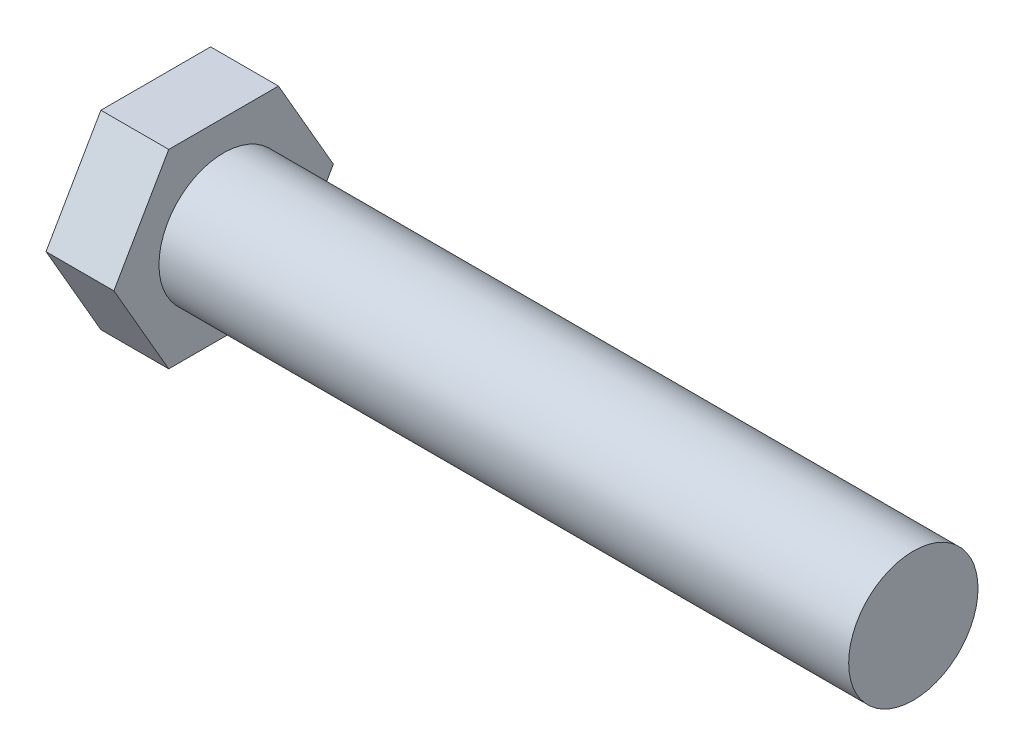
ISO-10303-21;
HEADER;
FILE_DESCRIPTION(('STEP AP214'),'2;1');
FILE_NAME('part.step','',(''),(''),'','','');
FILE_SCHEMA(('AUTOMOTIVE_DESIGN { 1 0 10303 214 1 1 1 1 }'));
ENDSEC;
DATA;
#1=APPLICATION_CONTEXT('core data for automotive mechanical design processes');
#2=APPLICATION_PROTOCOL_DEFINITION('international standard','automotive_design',2000,#1);
#3=PRODUCT_CONTEXT('',#1,'mechanical');
#4=PRODUCT('Part','Part','',(#3));
#5=PRODUCT_RELATED_PRODUCT_CATEGORY('part','',(#4));
#6=PRODUCT_DEFINITION_FORMATION('','',#4);
#7=PRODUCT_DEFINITION_CONTEXT('part definition',#1,'design');
#8=PRODUCT_DEFINITION('design','',#6,#7);
#9=PRODUCT_DEFINITION_SHAPE('','',#8);
#10=(LENGTH_UNIT() NAMED_UNIT(*) SI_UNIT(.MILLI.,.METRE.));
#11=(NAMED_UNIT(*) PLANE_ANGLE_UNIT() SI_UNIT($,.RADIAN.));
#12=(NAMED_UNIT(*) SI_UNIT($,.STERADIAN.) SOLID_ANGLE_UNIT());
#13=UNCERTAINTY_MEASURE_WITH_UNIT(LENGTH_MEASURE(1.E-05),#10,'distance_accuracy_value','');
#14=(GEOMETRIC_REPRESENTATION_CONTEXT(3) GLOBAL_UNCERTAINTY_ASSIGNED_CONTEXT((#13)) GLOBAL_UNIT_ASSIGNED_CONTEXT((#10,
#11,#12)) REPRESENTATION_CONTEXT('',''));
#15=CARTESIAN_POINT('',(0.,0.,0.));
#16=DIRECTION('',(0.,0.,1.));
#17=DIRECTION('',(1.,0.,0.));
#18=AXIS2_PLACEMENT_3D('',#15,#16,#17);
#19=CARTESIAN_POINT('',(50.8,0.,0.));
#20=DIRECTION('',(-1.,0.,0.));
#21=DIRECTION('',(0.,0.,1.));
#22=AXIS2_PLACEMENT_3D('',#19,#20,#21);
#23=CYLINDRICAL_SURFACE('',#22,4.7625);
#24=CARTESIAN_POINT('',(50.8,0.,0.));
#25=DIRECTION('',(1.,0.,0.));
#26=DIRECTION('',(0.,0.,-1.));
#27=AXIS2_PLACEMENT_3D('',#24,#25,#26);
#28=CIRCLE('',#27,4.7625);
#29=CARTESIAN_POINT('',(50.8,0.,-4.7625));
#30=VERTEX_POINT('',#29);
#31=EDGE_CURVE('E11',#30,#30,#28,.T.);
#32=ORIENTED_EDGE('',*,*,#31,.F.);
#33=EDGE_LOOP('',(#32));
#34=FACE_BOUND('',#33,.T.);
#35=CARTESIAN_POINT('',(0.,0.,0.));
#36=DIRECTION('',(-1.,0.,0.));
#37=DIRECTION('',(0.,0.,1.));
#38=AXIS2_PLACEMENT_3D('',#35,#36,#37);
#39=CIRCLE('',#38,4.7625);
#40=CARTESIAN_POINT('',(0.,0.,4.7625));
#41=VERTEX_POINT('',#40);
#42=EDGE_CURVE('E41',#41,#41,#39,.T.);
#43=ORIENTED_EDGE('',*,*,#42,.F.);
#44=EDGE_LOOP('',(#43));
#45=FACE_BOUND('',#44,.T.);
#46=ADVANCED_FACE('F33',(#34,#45),#23,.T.);
#47=CARTESIAN_POINT('',(50.8,0.,0.));
#48=DIRECTION('',(1.,0.,0.));
#49=DIRECTION('',(0.,0.,-1.));
#50=AXIS2_PLACEMENT_3D('',#47,#48,#49);
#51=PLANE('',#50);
#52=ORIENTED_EDGE('',*,*,#31,.T.);
#53=EDGE_LOOP('',(#52));
#54=FACE_BOUND('',#53,.T.);
#55=ADVANCED_FACE('F142',(#54),#51,.T.);
#56=CARTESIAN_POINT('',(0.,0.,0.));
#57=DIRECTION('',(-1.,0.,0.));
#58=DIRECTION('',(0.,0.,1.));
#59=AXIS2_PLACEMENT_3D('',#56,#57,#58);
#60=PLANE('',#59);
#61=DIRECTION('',(0.,0.866025403784439,0.5));
#62=VECTOR('',#61,1.);
#63=CARTESIAN_POINT('',(0.,-7.00000000000001,4.04145188432738));
#64=LINE('',#63,#62);
#65=CARTESIAN_POINT('',(0.,-7.00000000000001,4.04145188432738));
#66=VERTEX_POINT('',#65);
#67=CARTESIAN_POINT('',(0.,0.,8.08290376865477));
#68=VERTEX_POINT('',#67);
#69=EDGE_CURVE('E118',#66,#68,#64,.T.);
#70=ORIENTED_EDGE('',*,*,#69,.F.);
#71=DIRECTION('',(0.,0.,1.));
#72=VECTOR('',#71,1.);
#73=CARTESIAN_POINT('',(0.,-7.00000000000001,-4.04145188432739));
#74=LINE('',#73,#72);
#75=CARTESIAN_POINT('',(0.,-7.00000000000001,-4.04145188432739));
#76=VERTEX_POINT('',#75);
#77=EDGE_CURVE('E78',#76,#66,#74,.T.);
#78=ORIENTED_EDGE('',*,*,#77,.F.);
#79=DIRECTION('',(0.,-0.866025403784439,0.5));
#80=VECTOR('',#79,1.);
#81=CARTESIAN_POINT('',(0.,0.,-8.08290376865477));
#82=LINE('',#81,#80);
#83=CARTESIAN_POINT('',(0.,0.,-8.08290376865477));
#84=VERTEX_POINT('',#83);
#85=EDGE_CURVE('E72',#84,#76,#82,.T.);
#86=ORIENTED_EDGE('',*,*,#85,.F.);
#87=DIRECTION('',(0.,-0.866025403784439,-0.5));
#88=VECTOR('',#87,1.);
#89=CARTESIAN_POINT('',(0.,7.00000000000002,-4.04145188432739));
#90=LINE('',#89,#88);
#91=CARTESIAN_POINT('',(0.,7.00000000000002,-4.04145188432739));
#92=VERTEX_POINT('',#91);
#93=EDGE_CURVE('E108',#92,#84,#90,.T.);
#94=ORIENTED_EDGE('',*,*,#93,.F.);
#95=DIRECTION('',(0.,0.,-1.));
#96=VECTOR('',#95,1.);
#97=CARTESIAN_POINT('',(0.,7.00000000000002,4.04145188432738));
#98=LINE('',#97,#96);
#99=CARTESIAN_POINT('',(0.,7.00000000000002,4.04145188432738));
#100=VERTEX_POINT('',#99);
#101=EDGE_CURVE('E123',#100,#92,#98,.T.);
#102=ORIENTED_EDGE('',*,*,#101,.F.);
#103=DIRECTION('',(0.,0.866025403784439,-0.5));
#104=VECTOR('',#103,1.);
#105=CARTESIAN_POINT('',(0.,0.,8.08290376865477));
#106=LINE('',#105,#104);
#107=EDGE_CURVE('E121',#68,#100,#106,.T.);
#108=ORIENTED_EDGE('',*,*,#107,.F.);
#109=EDGE_LOOP('',(#70,#78,#86,#94,#102,#108));
#110=FACE_BOUND('',#109,.T.);
#111=ORIENTED_EDGE('',*,*,#42,.T.);
#112=EDGE_LOOP('',(#111));
#113=FACE_BOUND('',#112,.T.);
#114=ADVANCED_FACE('F139',(#110,#113),#60,.F.);
#115=CARTESIAN_POINT('',(-5.,-7.00000000000001,4.04145188432738));
#116=DIRECTION('',(0.,0.5,-0.866025403784439));
#117=DIRECTION('',(0.,0.866025403784439,0.5));
#118=AXIS2_PLACEMENT_3D('',#115,#116,#117);
#119=PLANE('',#118);
#120=ORIENTED_EDGE('',*,*,#69,.T.);
#121=DIRECTION('',(1.,0.,0.));
#122=VECTOR('',#121,1.);
#123=CARTESIAN_POINT('',(-5.,0.,8.08290376865477));
#124=LINE('',#123,#122);
#125=CARTESIAN_POINT('',(-5.,0.,8.08290376865477));
#126=VERTEX_POINT('',#125);
#127=EDGE_CURVE('E135',#126,#68,#124,.T.);
#128=ORIENTED_EDGE('',*,*,#127,.F.);
#129=DIRECTION('',(0.,0.866025403784439,0.5));
#130=VECTOR('',#129,1.);
#131=CARTESIAN_POINT('',(-5.,-7.00000000000001,4.04145188432738));
#132=LINE('',#131,#130);
#133=CARTESIAN_POINT('',(-5.,-7.00000000000001,4.04145188432738));
#134=VERTEX_POINT('',#133);
#135=EDGE_CURVE('E128',#134,#126,#132,.T.);
#136=ORIENTED_EDGE('',*,*,#135,.F.);
#137=DIRECTION('',(1.,0.,0.));
#138=VECTOR('',#137,1.);
#139=CARTESIAN_POINT('',(-5.,-7.00000000000001,4.04145188432738));
#140=LINE('',#139,#138);
#141=EDGE_CURVE('E114',#134,#66,#140,.T.);
#142=ORIENTED_EDGE('',*,*,#141,.T.);
#143=EDGE_LOOP('',(#120,#128,#136,#142));
#144=FACE_BOUND('',#143,.T.);
#145=ADVANCED_FACE('F152',(#144),#119,.F.);
#146=CARTESIAN_POINT('',(-5.,0.,8.08290376865477));
#147=DIRECTION('',(0.,-0.5,-0.866025403784438));
#148=DIRECTION('',(0.,0.866025403784438,-0.5));
#149=AXIS2_PLACEMENT_3D('',#146,#147,#148);
#150=PLANE('',#149);
#151=ORIENTED_EDGE('',*,*,#107,.T.);
#152=DIRECTION('',(1.,0.,0.));
#153=VECTOR('',#152,1.);
#154=CARTESIAN_POINT('',(-5.,7.00000000000002,4.04145188432738));
#155=LINE('',#154,#153);
#156=CARTESIAN_POINT('',(-5.,7.00000000000002,4.04145188432738));
#157=VERTEX_POINT('',#156);
#158=EDGE_CURVE('E132',#157,#100,#155,.T.);
#159=ORIENTED_EDGE('',*,*,#158,.F.);
#160=DIRECTION('',(0.,0.866025403784439,-0.5));
#161=VECTOR('',#160,1.);
#162=CARTESIAN_POINT('',(-5.,0.,8.08290376865477));
#163=LINE('',#162,#161);
#164=EDGE_CURVE('E87',#126,#157,#163,.T.);
#165=ORIENTED_EDGE('',*,*,#164,.F.);
#166=ORIENTED_EDGE('',*,*,#127,.T.);
#167=EDGE_LOOP('',(#151,#159,#165,#166));
#168=FACE_BOUND('',#167,.T.);
#169=ADVANCED_FACE('F158',(#168),#150,.F.);
#170=CARTESIAN_POINT('',(-5.,7.00000000000002,4.04145188432738));
#171=DIRECTION('',(0.,-1.,0.));
#172=DIRECTION('',(0.,0.,-1.));
#173=AXIS2_PLACEMENT_3D('',#170,#171,#172);
#174=PLANE('',#173);
#175=ORIENTED_EDGE('',*,*,#101,.T.);
#176=DIRECTION('',(1.,0.,0.));
#177=VECTOR('',#176,1.);
#178=CARTESIAN_POINT('',(-5.,7.00000000000002,-4.04145188432739));
#179=LINE('',#178,#177);
#180=CARTESIAN_POINT('',(-5.,7.00000000000002,-4.04145188432739));
#181=VERTEX_POINT('',#180);
#182=EDGE_CURVE('E109',#181,#92,#179,.T.);
#183=ORIENTED_EDGE('',*,*,#182,.F.);
#184=DIRECTION('',(0.,0.,-1.));
#185=VECTOR('',#184,1.);
#186=CARTESIAN_POINT('',(-5.,7.00000000000002,4.04145188432738));
#187=LINE('',#186,#185);
#188=EDGE_CURVE('E100',#157,#181,#187,.T.);
#189=ORIENTED_EDGE('',*,*,#188,.F.);
#190=ORIENTED_EDGE('',*,*,#158,.T.);
#191=EDGE_LOOP('',(#175,#183,#189,#190));
#192=FACE_BOUND('',#191,.T.);
#193=ADVANCED_FACE('F162',(#192),#174,.F.);
#194=CARTESIAN_POINT('',(-5.,7.00000000000002,-4.04145188432739));
#195=DIRECTION('',(0.,-0.5,0.866025403784439));
#196=DIRECTION('',(0.,-0.866025403784439,-0.5));
#197=AXIS2_PLACEMENT_3D('',#194,#195,#196);
#198=PLANE('',#197);
#199=ORIENTED_EDGE('',*,*,#93,.T.);
#200=DIRECTION('',(1.,0.,0.));
#201=VECTOR('',#200,1.);
#202=CARTESIAN_POINT('',(-5.,0.,-8.08290376865477));
#203=LINE('',#202,#201);
#204=CARTESIAN_POINT('',(-5.,0.,-8.08290376865477));
#205=VERTEX_POINT('',#204);
#206=EDGE_CURVE('E105',#205,#84,#203,.T.);
#207=ORIENTED_EDGE('',*,*,#206,.F.);
#208=DIRECTION('',(0.,-0.866025403784439,-0.5));
#209=VECTOR('',#208,1.);
#210=CARTESIAN_POINT('',(-5.,7.00000000000002,-4.04145188432739));
#211=LINE('',#210,#209);
#212=EDGE_CURVE('E94',#181,#205,#211,.T.);
#213=ORIENTED_EDGE('',*,*,#212,.F.);
#214=ORIENTED_EDGE('',*,*,#182,.T.);
#215=EDGE_LOOP('',(#199,#207,#213,#214));
#216=FACE_BOUND('',#215,.T.);
#217=ADVANCED_FACE('F106',(#216),#198,.F.);
#218=CARTESIAN_POINT('',(-5.,0.,-8.08290376865477));
#219=DIRECTION('',(0.,0.5,0.866025403784438));
#220=DIRECTION('',(0.,-0.866025403784439,0.5));
#221=AXIS2_PLACEMENT_3D('',#218,#219,#220);
#222=PLANE('',#221);
#223=ORIENTED_EDGE('',*,*,#85,.T.);
#224=DIRECTION('',(1.,0.,0.));
#225=VECTOR('',#224,1.);
#226=CARTESIAN_POINT('',(-5.,-7.00000000000001,-4.04145188432739));
#227=LINE('',#226,#225);
#228=CARTESIAN_POINT('',(-5.,-7.00000000000001,-4.04145188432739));
#229=VERTEX_POINT('',#228);
#230=EDGE_CURVE('E110',#229,#76,#227,.T.);
#231=ORIENTED_EDGE('',*,*,#230,.F.);
#232=DIRECTION('',(0.,-0.866025403784439,0.5));
#233=VECTOR('',#232,1.);
#234=CARTESIAN_POINT('',(-5.,0.,-8.08290376865477));
#235=LINE('',#234,#233);
#236=EDGE_CURVE('E98',#205,#229,#235,.T.);
#237=ORIENTED_EDGE('',*,*,#236,.F.);
#238=ORIENTED_EDGE('',*,*,#206,.T.);
#239=EDGE_LOOP('',(#223,#231,#237,#238));
#240=FACE_BOUND('',#239,.T.);
#241=ADVANCED_FACE('F112',(#240),#222,.F.);
#242=CARTESIAN_POINT('',(-5.,-7.00000000000001,-4.04145188432739));
#243=DIRECTION('',(0.,1.,0.));
#244=DIRECTION('',(0.,0.,1.));
#245=AXIS2_PLACEMENT_3D('',#242,#243,#244);
#246=PLANE('',#245);
#247=ORIENTED_EDGE('',*,*,#77,.T.);
#248=ORIENTED_EDGE('',*,*,#141,.F.);
#249=DIRECTION('',(0.,0.,1.));
#250=VECTOR('',#249,1.);
#251=CARTESIAN_POINT('',(-5.,-7.00000000000001,-4.04145188432739));
#252=LINE('',#251,#250);
#253=EDGE_CURVE('E49',#229,#134,#252,.T.);
#254=ORIENTED_EDGE('',*,*,#253,.F.);
#255=ORIENTED_EDGE('',*,*,#230,.T.);
#256=EDGE_LOOP('',(#247,#248,#254,#255));
#257=FACE_BOUND('',#256,.T.);
#258=ADVANCED_FACE('F170',(#257),#246,.F.);
#259=CARTESIAN_POINT('',(-5.,0.,0.));
#260=DIRECTION('',(-1.,0.,0.));
#261=DIRECTION('',(0.,0.,1.));
#262=AXIS2_PLACEMENT_3D('',#259,#260,#261);
#263=PLANE('',#262);
#264=ORIENTED_EDGE('',*,*,#135,.T.);
#265=ORIENTED_EDGE('',*,*,#164,.T.);
#266=ORIENTED_EDGE('',*,*,#188,.T.);
#267=ORIENTED_EDGE('',*,*,#212,.T.);
#268=ORIENTED_EDGE('',*,*,#236,.T.);
#269=ORIENTED_EDGE('',*,*,#253,.T.);
#270=EDGE_LOOP('',(#264,#265,#266,#267,#268,#269));
#271=FACE_BOUND('',#270,.T.);
#272=ADVANCED_FACE('F96',(#271),#263,.T.);
#273=CLOSED_SHELL('',(#46,#55,#114,#145,#169,#193,#217,#241,#258,#272));
#274=MANIFOLD_SOLID_BREP('B2',#273);
#275=ADVANCED_BREP_SHAPE_REPRESENTATION('',(#18,#274),#14);
#276=SHAPE_DEFINITION_REPRESENTATION(#9,#275);
ENDSEC;
END-ISO-10303-21;
